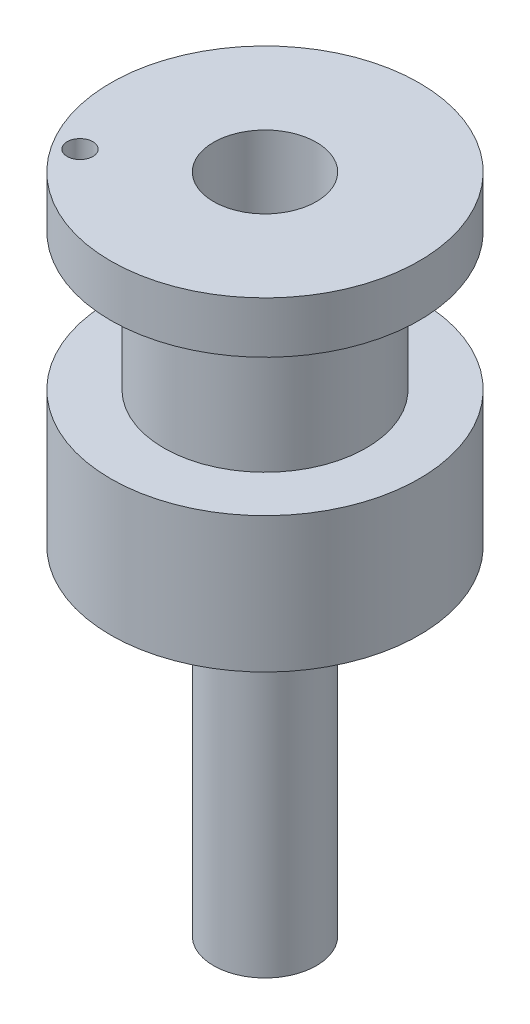
ISO-10303-21;
HEADER;
FILE_DESCRIPTION(('STEP AP214'),'2;1');
FILE_NAME('part.step','',(''),(''),'','','');
FILE_SCHEMA(('AUTOMOTIVE_DESIGN { 1 0 10303 214 1 1 1 1 }'));
ENDSEC;
DATA;
#1=APPLICATION_CONTEXT('core data for automotive mechanical design processes');
#2=APPLICATION_PROTOCOL_DEFINITION('international standard','automotive_design',2000,#1);
#3=PRODUCT_CONTEXT('',#1,'mechanical');
#4=PRODUCT('Part','Part','',(#3));
#5=PRODUCT_RELATED_PRODUCT_CATEGORY('part','',(#4));
#6=PRODUCT_DEFINITION_FORMATION('','',#4);
#7=PRODUCT_DEFINITION_CONTEXT('part definition',#1,'design');
#8=PRODUCT_DEFINITION('design','',#6,#7);
#9=PRODUCT_DEFINITION_SHAPE('','',#8);
#10=(LENGTH_UNIT() NAMED_UNIT(*) SI_UNIT(.MILLI.,.METRE.));
#11=(NAMED_UNIT(*) PLANE_ANGLE_UNIT() SI_UNIT($,.RADIAN.));
#12=(NAMED_UNIT(*) SI_UNIT($,.STERADIAN.) SOLID_ANGLE_UNIT());
#13=UNCERTAINTY_MEASURE_WITH_UNIT(LENGTH_MEASURE(1.E-05),#10,'distance_accuracy_value','');
#14=(GEOMETRIC_REPRESENTATION_CONTEXT(3) GLOBAL_UNCERTAINTY_ASSIGNED_CONTEXT((#13)) GLOBAL_UNIT_ASSIGNED_CONTEXT((#10,
#11,#12)) REPRESENTATION_CONTEXT('',''));
#15=CARTESIAN_POINT('',(0.,0.,0.));
#16=DIRECTION('',(0.,0.,1.));
#17=DIRECTION('',(1.,0.,0.));
#18=AXIS2_PLACEMENT_3D('',#15,#16,#17);
#19=CARTESIAN_POINT('',(0.,27.6,0.));
#20=DIRECTION('',(0.,1.,0.));
#21=DIRECTION('',(0.,0.,1.));
#22=AXIS2_PLACEMENT_3D('',#19,#20,#21);
#23=PLANE('',#22);
#24=CARTESIAN_POINT('',(0.,27.6,0.));
#25=DIRECTION('',(0.,1.,0.));
#26=DIRECTION('',(0.,0.,1.));
#27=AXIS2_PLACEMENT_3D('',#24,#25,#26);
#28=CIRCLE('',#27,9.);
#29=CARTESIAN_POINT('',(0.,27.6,9.));
#30=VERTEX_POINT('',#29);
#31=EDGE_CURVE('E45',#30,#30,#28,.T.);
#32=ORIENTED_EDGE('',*,*,#31,.T.);
#33=EDGE_LOOP('',(#32));
#34=FACE_BOUND('',#33,.T.);
#35=CARTESIAN_POINT('',(0.,27.6,0.));
#36=DIRECTION('',(0.,1.,0.));
#37=DIRECTION('',(0.,0.,1.));
#38=AXIS2_PLACEMENT_3D('',#35,#36,#37);
#39=CIRCLE('',#38,5.9);
#40=CARTESIAN_POINT('',(0.,27.6,5.9));
#41=VERTEX_POINT('',#40);
#42=EDGE_CURVE('E53',#41,#41,#39,.T.);
#43=ORIENTED_EDGE('',*,*,#42,.F.);
#44=EDGE_LOOP('',(#43));
#45=FACE_BOUND('',#44,.T.);
#46=ADVANCED_FACE('F34',(#34,#45),#23,.T.);
#47=CARTESIAN_POINT('',(0.,19.7,0.));
#48=DIRECTION('',(0.,-1.,0.));
#49=DIRECTION('',(0.,0.,-1.));
#50=AXIS2_PLACEMENT_3D('',#47,#48,#49);
#51=CYLINDRICAL_SURFACE('',#50,3.);
#52=CARTESIAN_POINT('',(0.,19.7,0.));
#53=DIRECTION('',(0.,1.,0.));
#54=DIRECTION('',(0.,0.,1.));
#55=AXIS2_PLACEMENT_3D('',#52,#53,#54);
#56=CIRCLE('',#55,3.);
#57=CARTESIAN_POINT('',(0.,19.7,3.));
#58=VERTEX_POINT('',#57);
#59=EDGE_CURVE('E10',#58,#58,#56,.T.);
#60=ORIENTED_EDGE('',*,*,#59,.F.);
#61=EDGE_LOOP('',(#60));
#62=FACE_BOUND('',#61,.T.);
#63=CARTESIAN_POINT('',(0.,0.,0.));
#64=DIRECTION('',(0.,1.,0.));
#65=DIRECTION('',(0.,0.,1.));
#66=AXIS2_PLACEMENT_3D('',#63,#64,#65);
#67=CIRCLE('',#66,3.);
#68=CARTESIAN_POINT('',(0.,0.,3.));
#69=VERTEX_POINT('',#68);
#70=EDGE_CURVE('E38',#69,#69,#67,.T.);
#71=ORIENTED_EDGE('',*,*,#70,.T.);
#72=EDGE_LOOP('',(#71));
#73=FACE_BOUND('',#72,.T.);
#74=ADVANCED_FACE('F36',(#62,#73),#51,.T.);
#75=CARTESIAN_POINT('',(0.,0.,0.));
#76=DIRECTION('',(0.,1.,0.));
#77=DIRECTION('',(0.,0.,1.));
#78=AXIS2_PLACEMENT_3D('',#75,#76,#77);
#79=PLANE('',#78);
#80=ORIENTED_EDGE('',*,*,#70,.F.);
#81=EDGE_LOOP('',(#80));
#82=FACE_BOUND('',#81,.T.);
#83=ADVANCED_FACE('F115',(#82),#79,.F.);
#84=CARTESIAN_POINT('',(0.,19.7,0.));
#85=DIRECTION('',(0.,1.,0.));
#86=DIRECTION('',(0.,0.,1.));
#87=AXIS2_PLACEMENT_3D('',#84,#85,#86);
#88=PLANE('',#87);
#89=CARTESIAN_POINT('',(0.,19.7,0.));
#90=DIRECTION('',(0.,1.,0.));
#91=DIRECTION('',(0.,0.,1.));
#92=AXIS2_PLACEMENT_3D('',#89,#90,#91);
#93=CIRCLE('',#92,9.);
#94=CARTESIAN_POINT('',(0.,19.7,9.));
#95=VERTEX_POINT('',#94);
#96=EDGE_CURVE('E47',#95,#95,#93,.T.);
#97=ORIENTED_EDGE('',*,*,#96,.F.);
#98=EDGE_LOOP('',(#97));
#99=FACE_BOUND('',#98,.T.);
#100=ORIENTED_EDGE('',*,*,#59,.T.);
#101=EDGE_LOOP('',(#100));
#102=FACE_BOUND('',#101,.T.);
#103=ADVANCED_FACE('F118',(#99,#102),#88,.F.);
#104=CARTESIAN_POINT('',(0.,27.6,0.));
#105=DIRECTION('',(0.,-1.,0.));
#106=DIRECTION('',(0.,0.,-1.));
#107=AXIS2_PLACEMENT_3D('',#104,#105,#106);
#108=CYLINDRICAL_SURFACE('',#107,9.);
#109=ORIENTED_EDGE('',*,*,#31,.F.);
#110=EDGE_LOOP('',(#109));
#111=FACE_BOUND('',#110,.T.);
#112=ORIENTED_EDGE('',*,*,#96,.T.);
#113=EDGE_LOOP('',(#112));
#114=FACE_BOUND('',#113,.T.);
#115=ADVANCED_FACE('F105',(#111,#114),#108,.T.);
#116=CARTESIAN_POINT('',(0.,35.6,0.));
#117=DIRECTION('',(0.,-1.,0.));
#118=DIRECTION('',(0.,0.,-1.));
#119=AXIS2_PLACEMENT_3D('',#116,#117,#118);
#120=CYLINDRICAL_SURFACE('',#119,5.9);
#121=CARTESIAN_POINT('',(0.,35.6,0.));
#122=DIRECTION('',(0.,1.,0.));
#123=DIRECTION('',(0.,0.,1.));
#124=AXIS2_PLACEMENT_3D('',#121,#122,#123);
#125=CIRCLE('',#124,5.9);
#126=CARTESIAN_POINT('',(0.,35.6,5.9));
#127=VERTEX_POINT('',#126);
#128=EDGE_CURVE('E50',#127,#127,#125,.T.);
#129=ORIENTED_EDGE('',*,*,#128,.F.);
#130=EDGE_LOOP('',(#129));
#131=FACE_BOUND('',#130,.T.);
#132=ORIENTED_EDGE('',*,*,#42,.T.);
#133=EDGE_LOOP('',(#132));
#134=FACE_BOUND('',#133,.T.);
#135=ADVANCED_FACE('F98',(#131,#134),#120,.T.);
#136=CARTESIAN_POINT('',(0.,35.6,0.));
#137=DIRECTION('',(0.,1.,0.));
#138=DIRECTION('',(0.,0.,1.));
#139=AXIS2_PLACEMENT_3D('',#136,#137,#138);
#140=PLANE('',#139);
#141=CARTESIAN_POINT('',(-6.55100535031026,35.6,4.23995624061733));
#142=DIRECTION('',(0.,1.,0.));
#143=DIRECTION('',(0.,0.,1.));
#144=AXIS2_PLACEMENT_3D('',#141,#142,#143);
#145=CIRCLE('',#144,0.75);
#146=CARTESIAN_POINT('',(-6.55100535031026,35.6,4.98995624061733));
#147=VERTEX_POINT('',#146);
#148=EDGE_CURVE('E68',#147,#147,#145,.T.);
#149=ORIENTED_EDGE('',*,*,#148,.T.);
#150=EDGE_LOOP('',(#149));
#151=FACE_BOUND('',#150,.T.);
#152=CARTESIAN_POINT('',(0.,35.6,0.));
#153=DIRECTION('',(0.,1.,0.));
#154=DIRECTION('',(0.,0.,1.));
#155=AXIS2_PLACEMENT_3D('',#152,#153,#154);
#156=CIRCLE('',#155,9.);
#157=CARTESIAN_POINT('',(0.,35.6,9.));
#158=VERTEX_POINT('',#157);
#159=EDGE_CURVE('E59',#158,#158,#156,.T.);
#160=ORIENTED_EDGE('',*,*,#159,.F.);
#161=EDGE_LOOP('',(#160));
#162=FACE_BOUND('',#161,.T.);
#163=ORIENTED_EDGE('',*,*,#128,.T.);
#164=EDGE_LOOP('',(#163));
#165=FACE_BOUND('',#164,.T.);
#166=ADVANCED_FACE('F92',(#151,#162,#165),#140,.F.);
#167=CARTESIAN_POINT('',(0.,38.6,0.));
#168=DIRECTION('',(0.,-1.,0.));
#169=DIRECTION('',(0.,0.,-1.));
#170=AXIS2_PLACEMENT_3D('',#167,#168,#169);
#171=CYLINDRICAL_SURFACE('',#170,9.);
#172=CARTESIAN_POINT('',(0.,38.6,0.));
#173=DIRECTION('',(0.,1.,0.));
#174=DIRECTION('',(0.,0.,1.));
#175=AXIS2_PLACEMENT_3D('',#172,#173,#174);
#176=CIRCLE('',#175,9.);
#177=CARTESIAN_POINT('',(0.,38.6,9.));
#178=VERTEX_POINT('',#177);
#179=EDGE_CURVE('E56',#178,#178,#176,.T.);
#180=ORIENTED_EDGE('',*,*,#179,.F.);
#181=EDGE_LOOP('',(#180));
#182=FACE_BOUND('',#181,.T.);
#183=ORIENTED_EDGE('',*,*,#159,.T.);
#184=EDGE_LOOP('',(#183));
#185=FACE_BOUND('',#184,.T.);
#186=ADVANCED_FACE('F84',(#182,#185),#171,.T.);
#187=CARTESIAN_POINT('',(0.,38.6,0.));
#188=DIRECTION('',(0.,1.,0.));
#189=DIRECTION('',(0.,0.,1.));
#190=AXIS2_PLACEMENT_3D('',#187,#188,#189);
#191=PLANE('',#190);
#192=CARTESIAN_POINT('',(-6.55100535031026,38.6,4.23995624061733));
#193=DIRECTION('',(0.,1.,0.));
#194=DIRECTION('',(0.,0.,1.));
#195=AXIS2_PLACEMENT_3D('',#192,#193,#194);
#196=CIRCLE('',#195,0.75);
#197=CARTESIAN_POINT('',(-6.55100535031026,38.6,4.98995624061733));
#198=VERTEX_POINT('',#197);
#199=EDGE_CURVE('E73',#198,#198,#196,.T.);
#200=ORIENTED_EDGE('',*,*,#199,.F.);
#201=EDGE_LOOP('',(#200));
#202=FACE_BOUND('',#201,.T.);
#203=CARTESIAN_POINT('',(0.,38.6,0.));
#204=DIRECTION('',(0.,1.,0.));
#205=DIRECTION('',(0.,0.,1.));
#206=AXIS2_PLACEMENT_3D('',#203,#204,#205);
#207=CIRCLE('',#206,3.);
#208=CARTESIAN_POINT('',(0.,38.6,3.));
#209=VERTEX_POINT('',#208);
#210=EDGE_CURVE('E65',#209,#209,#207,.T.);
#211=ORIENTED_EDGE('',*,*,#210,.F.);
#212=EDGE_LOOP('',(#211));
#213=FACE_BOUND('',#212,.T.);
#214=ORIENTED_EDGE('',*,*,#179,.T.);
#215=EDGE_LOOP('',(#214));
#216=FACE_BOUND('',#215,.T.);
#217=ADVANCED_FACE('F80',(#202,#213,#216),#191,.T.);
#218=CARTESIAN_POINT('',(0.,29.,0.));
#219=DIRECTION('',(0.,1.,0.));
#220=DIRECTION('',(0.,0.,1.));
#221=AXIS2_PLACEMENT_3D('',#218,#219,#220);
#222=CYLINDRICAL_SURFACE('',#221,3.);
#223=CARTESIAN_POINT('',(0.,29.,0.));
#224=DIRECTION('',(0.,1.,0.));
#225=DIRECTION('',(0.,0.,1.));
#226=AXIS2_PLACEMENT_3D('',#223,#224,#225);
#227=CIRCLE('',#226,3.);
#228=CARTESIAN_POINT('',(0.,29.,3.));
#229=VERTEX_POINT('',#228);
#230=EDGE_CURVE('E62',#229,#229,#227,.T.);
#231=ORIENTED_EDGE('',*,*,#230,.F.);
#232=EDGE_LOOP('',(#231));
#233=FACE_BOUND('',#232,.T.);
#234=ORIENTED_EDGE('',*,*,#210,.T.);
#235=EDGE_LOOP('',(#234));
#236=FACE_BOUND('',#235,.T.);
#237=ADVANCED_FACE('F83',(#233,#236),#222,.F.);
#238=CARTESIAN_POINT('',(0.,29.,0.));
#239=DIRECTION('',(0.,1.,0.));
#240=DIRECTION('',(0.,0.,1.));
#241=AXIS2_PLACEMENT_3D('',#238,#239,#240);
#242=PLANE('',#241);
#243=ORIENTED_EDGE('',*,*,#230,.T.);
#244=EDGE_LOOP('',(#243));
#245=FACE_BOUND('',#244,.T.);
#246=ADVANCED_FACE('F164',(#245),#242,.T.);
#247=CARTESIAN_POINT('',(-6.55100535031026,28.6,4.23995624061733));
#248=DIRECTION('',(0.,1.,0.));
#249=DIRECTION('',(0.,0.,1.));
#250=AXIS2_PLACEMENT_3D('',#247,#248,#249);
#251=CYLINDRICAL_SURFACE('',#250,0.75);
#252=ORIENTED_EDGE('',*,*,#199,.T.);
#253=EDGE_LOOP('',(#252));
#254=FACE_BOUND('',#253,.T.);
#255=ORIENTED_EDGE('',*,*,#148,.F.);
#256=EDGE_LOOP('',(#255));
#257=FACE_BOUND('',#256,.T.);
#258=ADVANCED_FACE('F77',(#254,#257),#251,.F.);
#259=CLOSED_SHELL('',(#46,#74,#83,#103,#115,#135,#166,#186,#217,#237,#246,#258));
#260=MANIFOLD_SOLID_BREP('B2',#259);
#261=ADVANCED_BREP_SHAPE_REPRESENTATION('',(#18,#260),#14);
#262=SHAPE_DEFINITION_REPRESENTATION(#9,#261);
ENDSEC;
END-ISO-10303-21;
